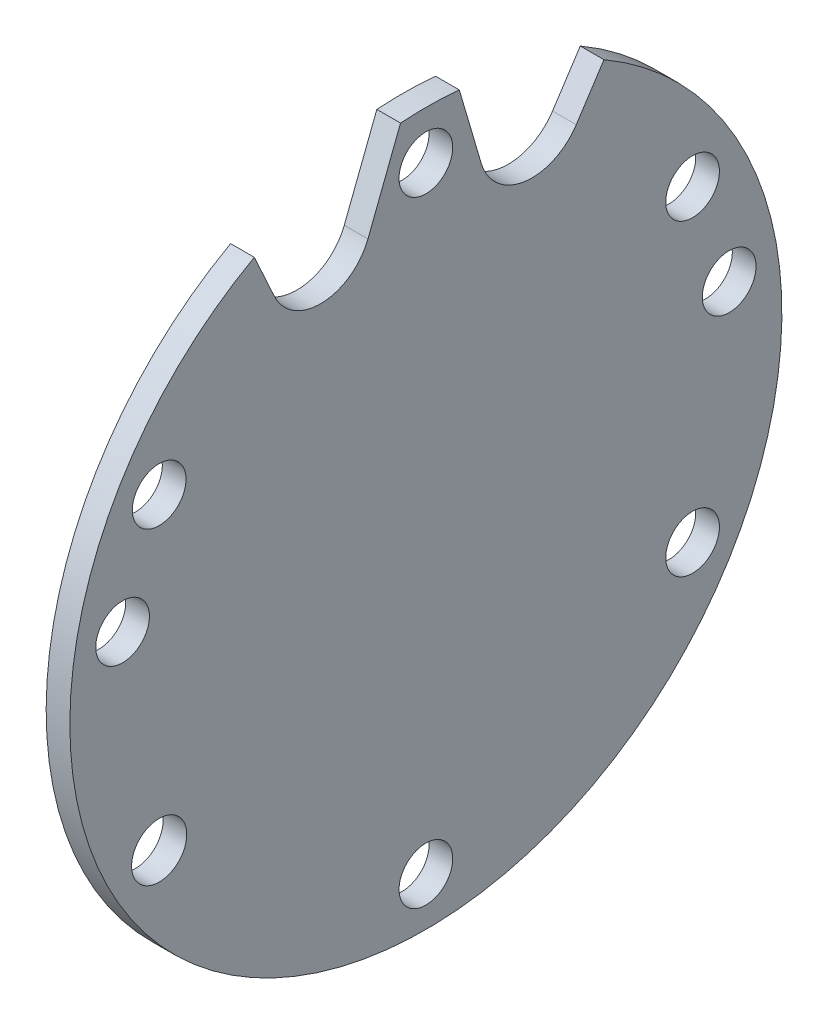
ISO-10303-21;
HEADER;
FILE_DESCRIPTION(('STEP AP214'),'2;1');
FILE_NAME('part.step','',(''),(''),'','','');
FILE_SCHEMA(('AUTOMOTIVE_DESIGN { 1 0 10303 214 1 1 1 1 }'));
ENDSEC;
DATA;
#1=APPLICATION_CONTEXT('core data for automotive mechanical design processes');
#2=APPLICATION_PROTOCOL_DEFINITION('international standard','automotive_design',2000,#1);
#3=PRODUCT_CONTEXT('',#1,'mechanical');
#4=PRODUCT('Part','Part','',(#3));
#5=PRODUCT_RELATED_PRODUCT_CATEGORY('part','',(#4));
#6=PRODUCT_DEFINITION_FORMATION('','',#4);
#7=PRODUCT_DEFINITION_CONTEXT('part definition',#1,'design');
#8=PRODUCT_DEFINITION('design','',#6,#7);
#9=PRODUCT_DEFINITION_SHAPE('','',#8);
#10=(LENGTH_UNIT() NAMED_UNIT(*) SI_UNIT(.MILLI.,.METRE.));
#11=(NAMED_UNIT(*) PLANE_ANGLE_UNIT() SI_UNIT($,.RADIAN.));
#12=(NAMED_UNIT(*) SI_UNIT($,.STERADIAN.) SOLID_ANGLE_UNIT());
#13=UNCERTAINTY_MEASURE_WITH_UNIT(LENGTH_MEASURE(1.E-05),#10,'distance_accuracy_value','');
#14=(GEOMETRIC_REPRESENTATION_CONTEXT(3) GLOBAL_UNCERTAINTY_ASSIGNED_CONTEXT((#13)) GLOBAL_UNIT_ASSIGNED_CONTEXT((#10,
#11,#12)) REPRESENTATION_CONTEXT('',''));
#15=CARTESIAN_POINT('',(0.,0.,0.));
#16=DIRECTION('',(0.,0.,1.));
#17=DIRECTION('',(1.,0.,0.));
#18=AXIS2_PLACEMENT_3D('',#15,#16,#17);
#19=CARTESIAN_POINT('',(3.,0.,0.));
#20=DIRECTION('',(1.,0.,0.));
#21=DIRECTION('',(0.,0.,-1.));
#22=AXIS2_PLACEMENT_3D('',#19,#20,#21);
#23=PLANE('',#22);
#24=CARTESIAN_POINT('',(3.,6.77227892894371,38.4075023674159));
#25=DIRECTION('',(1.,0.,0.));
#26=DIRECTION('',(0.,0.,-1.));
#27=AXIS2_PLACEMENT_3D('',#24,#25,#26);
#28=CIRCLE('',#27,3.4);
#29=CARTESIAN_POINT('',(3.,6.77227892894371,35.0075023674159));
#30=VERTEX_POINT('',#29);
#31=EDGE_CURVE('E212',#30,#30,#28,.T.);
#32=ORIENTED_EDGE('',*,*,#31,.F.);
#33=EDGE_LOOP('',(#32));
#34=FACE_BOUND('',#33,.T.);
#35=CARTESIAN_POINT('',(3.,-39.0000000000018,0.));
#36=DIRECTION('',(1.,0.,0.));
#37=DIRECTION('',(0.,0.,-1.));
#38=AXIS2_PLACEMENT_3D('',#35,#36,#37);
#39=CIRCLE('',#38,3.39999999982866);
#40=CARTESIAN_POINT('',(3.,-39.0000000000018,-3.39999999982866));
#41=VERTEX_POINT('',#40);
#42=EDGE_CURVE('E200',#41,#41,#39,.T.);
#43=ORIENTED_EDGE('',*,*,#42,.F.);
#44=EDGE_LOOP('',(#43));
#45=FACE_BOUND('',#44,.T.);
#46=CARTESIAN_POINT('',(3.,6.77227892894371,-38.4075023675377));
#47=DIRECTION('',(1.,0.,0.));
#48=DIRECTION('',(0.,0.,-1.));
#49=AXIS2_PLACEMENT_3D('',#46,#47,#48);
#50=CIRCLE('',#49,3.39999999994234);
#51=CARTESIAN_POINT('',(3.,6.77227892894371,-41.80750236748));
#52=VERTEX_POINT('',#51);
#53=EDGE_CURVE('E188',#52,#52,#50,.T.);
#54=ORIENTED_EDGE('',*,*,#53,.F.);
#55=EDGE_LOOP('',(#54));
#56=FACE_BOUND('',#55,.T.);
#57=CARTESIAN_POINT('',(3.,38.9999999999983,0.));
#58=DIRECTION('',(1.,0.,0.));
#59=DIRECTION('',(0.,0.,-1.));
#60=AXIS2_PLACEMENT_3D('',#57,#58,#59);
#61=CIRCLE('',#60,3.4);
#62=CARTESIAN_POINT('',(3.,38.9999999999983,-3.4));
#63=VERTEX_POINT('',#62);
#64=EDGE_CURVE('E134',#63,#63,#61,.T.);
#65=ORIENTED_EDGE('',*,*,#64,.F.);
#66=EDGE_LOOP('',(#65));
#67=FACE_BOUND('',#66,.T.);
#68=CARTESIAN_POINT('',(3.,0.,0.));
#69=DIRECTION('',(1.,0.,0.));
#70=DIRECTION('',(0.,0.,-1.));
#71=AXIS2_PLACEMENT_3D('',#68,#69,#70);
#72=CIRCLE('',#71,45.085);
#73=CARTESIAN_POINT('',(3.,39.5056464022037,21.7246663344698));
#74=VERTEX_POINT('',#73);
#75=CARTESIAN_POINT('',(3.,39.0393716674637,-22.5518222059689));
#76=VERTEX_POINT('',#75);
#77=EDGE_CURVE('E145',#74,#76,#72,.T.);
#78=ORIENTED_EDGE('',*,*,#77,.T.);
#79=DIRECTION('',(0.,-0.837514204424526,0.54641555375662));
#80=VECTOR('',#79,1.);
#81=CARTESIAN_POINT('',(3.,39.0393716674637,-22.5518222059689));
#82=LINE('',#81,#80);
#83=CARTESIAN_POINT('',(3.,33.6604309775915,-19.0424645853419));
#84=VERTEX_POINT('',#83);
#85=EDGE_CURVE('E93',#76,#84,#82,.T.);
#86=ORIENTED_EDGE('',*,*,#85,.T.);
#87=CARTESIAN_POINT('',(3.,37.3174378151793,-13.4372157026894));
#88=DIRECTION('',(-1.,0.,0.));
#89=DIRECTION('',(0.,0.,-1.));
#90=AXIS2_PLACEMENT_3D('',#87,#88,#89);
#91=CIRCLE('',#90,6.69272097480854);
#92=CARTESIAN_POINT('',(3.,35.4278375985655,-7.01678541586162));
#93=VERTEX_POINT('',#92);
#94=EDGE_CURVE('E160',#84,#93,#91,.T.);
#95=ORIENTED_EDGE('',*,*,#94,.T.);
#96=DIRECTION('',(0.,0.959315398175767,0.282336619698668));
#97=VECTOR('',#96,1.);
#98=CARTESIAN_POINT('',(3.,44.8858244892491,-4.23320031658371));
#99=LINE('',#98,#97);
#100=CARTESIAN_POINT('',(3.,44.8858244892491,-4.23320031658371));
#101=VERTEX_POINT('',#100);
#102=EDGE_CURVE('E173',#93,#101,#99,.T.);
#103=ORIENTED_EDGE('',*,*,#102,.T.);
#104=CARTESIAN_POINT('',(3.,0.,0.));
#105=DIRECTION('',(1.,0.,0.));
#106=DIRECTION('',(0.,0.,-1.));
#107=AXIS2_PLACEMENT_3D('',#104,#105,#106);
#108=CIRCLE('',#107,45.085);
#109=CARTESIAN_POINT('',(3.,44.970493516031,3.21122062845424));
#110=VERTEX_POINT('',#109);
#111=EDGE_CURVE('E112',#101,#110,#108,.T.);
#112=ORIENTED_EDGE('',*,*,#111,.T.);
#113=DIRECTION('',(0.,-0.932517432610584,0.361124961581673));
#114=VECTOR('',#113,1.);
#115=CARTESIAN_POINT('',(3.,34.3228741062931,7.33459786067762));
#116=LINE('',#115,#114);
#117=CARTESIAN_POINT('',(3.,34.3228741062931,7.33459786067762));
#118=VERTEX_POINT('',#117);
#119=EDGE_CURVE('E106',#110,#118,#116,.T.);
#120=ORIENTED_EDGE('',*,*,#119,.T.);
#121=CARTESIAN_POINT('',(3.,36.6480449071196,13.338786261477));
#122=DIRECTION('',(-1.,0.,0.));
#123=DIRECTION('',(0.,0.,-1.));
#124=AXIS2_PLACEMENT_3D('',#121,#122,#123);
#125=CIRCLE('',#124,6.438687568543);
#126=CARTESIAN_POINT('',(3.,33.9711163746531,19.1946167950032));
#127=VERTEX_POINT('',#126);
#128=EDGE_CURVE('E110',#118,#127,#125,.T.);
#129=ORIENTED_EDGE('',*,*,#128,.T.);
#130=DIRECTION('',(0.,0.909475800959117,0.415756861001442));
#131=VECTOR('',#130,1.);
#132=CARTESIAN_POINT('',(3.,39.5056464022037,21.7246663344698));
#133=LINE('',#132,#131);
#134=EDGE_CURVE('E50',#127,#74,#133,.T.);
#135=ORIENTED_EDGE('',*,*,#134,.T.);
#136=EDGE_LOOP('',(#78,#86,#95,#103,#112,#120,#129,#135));
#137=FACE_BOUND('',#136,.T.);
#138=CARTESIAN_POINT('',(3.,19.4999999999982,-33.7749907475954));
#139=DIRECTION('',(1.,0.,0.));
#140=DIRECTION('',(0.,0.,-1.));
#141=AXIS2_PLACEMENT_3D('',#138,#139,#140);
#142=CIRCLE('',#141,3.3999999998855);
#143=CARTESIAN_POINT('',(3.,19.4999999999982,-37.1749907474809));
#144=VERTEX_POINT('',#143);
#145=EDGE_CURVE('E182',#144,#144,#142,.T.);
#146=ORIENTED_EDGE('',*,*,#145,.F.);
#147=EDGE_LOOP('',(#146));
#148=FACE_BOUND('',#147,.T.);
#149=CARTESIAN_POINT('',(3.,-19.5000000000018,-33.7749907475936));
#150=DIRECTION('',(1.,0.,0.));
#151=DIRECTION('',(0.,0.,-1.));
#152=AXIS2_PLACEMENT_3D('',#149,#150,#151);
#153=CIRCLE('',#152,3.39999999988546);
#154=CARTESIAN_POINT('',(3.,-19.5000000000018,-37.1749907474791));
#155=VERTEX_POINT('',#154);
#156=EDGE_CURVE('E194',#155,#155,#153,.T.);
#157=ORIENTED_EDGE('',*,*,#156,.F.);
#158=EDGE_LOOP('',(#157));
#159=FACE_BOUND('',#158,.T.);
#160=CARTESIAN_POINT('',(3.,-19.5000000000017,33.7749907475918));
#161=DIRECTION('',(1.,0.,0.));
#162=DIRECTION('',(0.,0.,-1.));
#163=AXIS2_PLACEMENT_3D('',#160,#161,#162);
#164=CIRCLE('',#163,3.49288290040631);
#165=CARTESIAN_POINT('',(3.,-19.5000000000017,30.2821078471855));
#166=VERTEX_POINT('',#165);
#167=EDGE_CURVE('E206',#166,#166,#164,.T.);
#168=ORIENTED_EDGE('',*,*,#167,.F.);
#169=EDGE_LOOP('',(#168));
#170=FACE_BOUND('',#169,.T.);
#171=CARTESIAN_POINT('',(3.,19.4999999999982,33.7749907475918));
#172=DIRECTION('',(1.,0.,0.));
#173=DIRECTION('',(0.,0.,-1.));
#174=AXIS2_PLACEMENT_3D('',#171,#172,#173);
#175=CIRCLE('',#174,3.4);
#176=CARTESIAN_POINT('',(3.,19.4999999999982,30.3749907475918));
#177=VERTEX_POINT('',#176);
#178=EDGE_CURVE('E218',#177,#177,#175,.T.);
#179=ORIENTED_EDGE('',*,*,#178,.F.);
#180=EDGE_LOOP('',(#179));
#181=FACE_BOUND('',#180,.T.);
#182=ADVANCED_FACE('F33',(#34,#45,#56,#67,#137,#148,#159,#170,#181),#23,.T.);
#183=CARTESIAN_POINT('',(0.,0.,0.));
#184=DIRECTION('',(1.,0.,0.));
#185=DIRECTION('',(0.,0.,-1.));
#186=AXIS2_PLACEMENT_3D('',#183,#184,#185);
#187=PLANE('',#186);
#188=CARTESIAN_POINT('',(0.,6.77227892894371,38.4075023674159));
#189=DIRECTION('',(1.,0.,0.));
#190=DIRECTION('',(0.,0.,-1.));
#191=AXIS2_PLACEMENT_3D('',#188,#189,#190);
#192=CIRCLE('',#191,3.4);
#193=CARTESIAN_POINT('',(0.,6.77227892894371,35.0075023674159));
#194=VERTEX_POINT('',#193);
#195=EDGE_CURVE('E215',#194,#194,#192,.T.);
#196=ORIENTED_EDGE('',*,*,#195,.T.);
#197=EDGE_LOOP('',(#196));
#198=FACE_BOUND('',#197,.T.);
#199=CARTESIAN_POINT('',(0.,-39.0000000000018,0.));
#200=DIRECTION('',(1.,0.,0.));
#201=DIRECTION('',(0.,0.,-1.));
#202=AXIS2_PLACEMENT_3D('',#199,#200,#201);
#203=CIRCLE('',#202,3.39999999982866);
#204=CARTESIAN_POINT('',(0.,-39.0000000000018,-3.39999999982866));
#205=VERTEX_POINT('',#204);
#206=EDGE_CURVE('E203',#205,#205,#203,.T.);
#207=ORIENTED_EDGE('',*,*,#206,.T.);
#208=EDGE_LOOP('',(#207));
#209=FACE_BOUND('',#208,.T.);
#210=CARTESIAN_POINT('',(0.,6.77227892894371,-38.4075023675377));
#211=DIRECTION('',(1.,0.,0.));
#212=DIRECTION('',(0.,0.,-1.));
#213=AXIS2_PLACEMENT_3D('',#210,#211,#212);
#214=CIRCLE('',#213,3.39999999994234);
#215=CARTESIAN_POINT('',(0.,6.77227892894371,-41.80750236748));
#216=VERTEX_POINT('',#215);
#217=EDGE_CURVE('E191',#216,#216,#214,.T.);
#218=ORIENTED_EDGE('',*,*,#217,.T.);
#219=EDGE_LOOP('',(#218));
#220=FACE_BOUND('',#219,.T.);
#221=CARTESIAN_POINT('',(0.,38.9999999999983,0.));
#222=DIRECTION('',(1.,0.,0.));
#223=DIRECTION('',(0.,0.,-1.));
#224=AXIS2_PLACEMENT_3D('',#221,#222,#223);
#225=CIRCLE('',#224,3.4);
#226=CARTESIAN_POINT('',(0.,38.9999999999983,-3.4));
#227=VERTEX_POINT('',#226);
#228=EDGE_CURVE('E179',#227,#227,#225,.T.);
#229=ORIENTED_EDGE('',*,*,#228,.T.);
#230=EDGE_LOOP('',(#229));
#231=FACE_BOUND('',#230,.T.);
#232=CARTESIAN_POINT('',(0.,0.,0.));
#233=DIRECTION('',(1.,0.,0.));
#234=DIRECTION('',(0.,0.,-1.));
#235=AXIS2_PLACEMENT_3D('',#232,#233,#234);
#236=CIRCLE('',#235,45.085);
#237=CARTESIAN_POINT('',(0.,39.5056464022037,21.7246663344698));
#238=VERTEX_POINT('',#237);
#239=CARTESIAN_POINT('',(0.,39.0393716674637,-22.5518222059689));
#240=VERTEX_POINT('',#239);
#241=EDGE_CURVE('E130',#238,#240,#236,.T.);
#242=ORIENTED_EDGE('',*,*,#241,.F.);
#243=DIRECTION('',(0.,0.909475800959117,0.415756861001442));
#244=VECTOR('',#243,1.);
#245=CARTESIAN_POINT('',(0.,39.5056464022037,21.7246663344698));
#246=LINE('',#245,#244);
#247=CARTESIAN_POINT('',(0.,33.9711163746531,19.1946167950032));
#248=VERTEX_POINT('',#247);
#249=EDGE_CURVE('E85',#248,#238,#246,.T.);
#250=ORIENTED_EDGE('',*,*,#249,.F.);
#251=CARTESIAN_POINT('',(0.,36.6480449071196,13.338786261477));
#252=DIRECTION('',(-1.,0.,0.));
#253=DIRECTION('',(0.,0.,-1.));
#254=AXIS2_PLACEMENT_3D('',#251,#252,#253);
#255=CIRCLE('',#254,6.438687568543);
#256=CARTESIAN_POINT('',(0.,34.3228741062931,7.33459786067762));
#257=VERTEX_POINT('',#256);
#258=EDGE_CURVE('E79',#257,#248,#255,.T.);
#259=ORIENTED_EDGE('',*,*,#258,.F.);
#260=DIRECTION('',(0.,-0.932517432610584,0.361124961581673));
#261=VECTOR('',#260,1.);
#262=CARTESIAN_POINT('',(0.,34.3228741062931,7.33459786067762));
#263=LINE('',#262,#261);
#264=CARTESIAN_POINT('',(0.,44.970493516031,3.21122062845424));
#265=VERTEX_POINT('',#264);
#266=EDGE_CURVE('E120',#265,#257,#263,.T.);
#267=ORIENTED_EDGE('',*,*,#266,.F.);
#268=CARTESIAN_POINT('',(0.,0.,0.));
#269=DIRECTION('',(1.,0.,0.));
#270=DIRECTION('',(0.,0.,-1.));
#271=AXIS2_PLACEMENT_3D('',#268,#269,#270);
#272=CIRCLE('',#271,45.085);
#273=CARTESIAN_POINT('',(0.,44.8858244892491,-4.23320031658371));
#274=VERTEX_POINT('',#273);
#275=EDGE_CURVE('E140',#274,#265,#272,.T.);
#276=ORIENTED_EDGE('',*,*,#275,.F.);
#277=DIRECTION('',(0.,0.959315398175767,0.282336619698668));
#278=VECTOR('',#277,1.);
#279=CARTESIAN_POINT('',(0.,44.8858244892491,-4.23320031658371));
#280=LINE('',#279,#278);
#281=CARTESIAN_POINT('',(0.,35.4278375985655,-7.01678541586162));
#282=VERTEX_POINT('',#281);
#283=EDGE_CURVE('E138',#282,#274,#280,.T.);
#284=ORIENTED_EDGE('',*,*,#283,.F.);
#285=CARTESIAN_POINT('',(0.,37.3174378151793,-13.4372157026894));
#286=DIRECTION('',(-1.,0.,0.));
#287=DIRECTION('',(0.,0.,-1.));
#288=AXIS2_PLACEMENT_3D('',#285,#286,#287);
#289=CIRCLE('',#288,6.69272097480854);
#290=CARTESIAN_POINT('',(0.,33.6604309775915,-19.0424645853419));
#291=VERTEX_POINT('',#290);
#292=EDGE_CURVE('E136',#291,#282,#289,.T.);
#293=ORIENTED_EDGE('',*,*,#292,.F.);
#294=DIRECTION('',(0.,-0.837514204424526,0.54641555375662));
#295=VECTOR('',#294,1.);
#296=CARTESIAN_POINT('',(0.,39.0393716674637,-22.5518222059689));
#297=LINE('',#296,#295);
#298=EDGE_CURVE('E133',#240,#291,#297,.T.);
#299=ORIENTED_EDGE('',*,*,#298,.F.);
#300=EDGE_LOOP('',(#242,#250,#259,#267,#276,#284,#293,#299));
#301=FACE_BOUND('',#300,.T.);
#302=CARTESIAN_POINT('',(0.,19.4999999999982,-33.7749907475954));
#303=DIRECTION('',(1.,0.,0.));
#304=DIRECTION('',(0.,0.,-1.));
#305=AXIS2_PLACEMENT_3D('',#302,#303,#304);
#306=CIRCLE('',#305,3.3999999998855);
#307=CARTESIAN_POINT('',(0.,19.4999999999982,-37.1749907474809));
#308=VERTEX_POINT('',#307);
#309=EDGE_CURVE('E185',#308,#308,#306,.T.);
#310=ORIENTED_EDGE('',*,*,#309,.T.);
#311=EDGE_LOOP('',(#310));
#312=FACE_BOUND('',#311,.T.);
#313=CARTESIAN_POINT('',(0.,-19.5000000000018,-33.7749907475936));
#314=DIRECTION('',(1.,0.,0.));
#315=DIRECTION('',(0.,0.,-1.));
#316=AXIS2_PLACEMENT_3D('',#313,#314,#315);
#317=CIRCLE('',#316,3.39999999988546);
#318=CARTESIAN_POINT('',(0.,-19.5000000000018,-37.1749907474791));
#319=VERTEX_POINT('',#318);
#320=EDGE_CURVE('E197',#319,#319,#317,.T.);
#321=ORIENTED_EDGE('',*,*,#320,.T.);
#322=EDGE_LOOP('',(#321));
#323=FACE_BOUND('',#322,.T.);
#324=CARTESIAN_POINT('',(0.,-19.5000000000017,33.7749907475918));
#325=DIRECTION('',(1.,0.,0.));
#326=DIRECTION('',(0.,0.,-1.));
#327=AXIS2_PLACEMENT_3D('',#324,#325,#326);
#328=CIRCLE('',#327,3.49288290040631);
#329=CARTESIAN_POINT('',(0.,-19.5000000000017,30.2821078471855));
#330=VERTEX_POINT('',#329);
#331=EDGE_CURVE('E209',#330,#330,#328,.T.);
#332=ORIENTED_EDGE('',*,*,#331,.T.);
#333=EDGE_LOOP('',(#332));
#334=FACE_BOUND('',#333,.T.);
#335=CARTESIAN_POINT('',(0.,19.4999999999982,33.7749907475918));
#336=DIRECTION('',(1.,0.,0.));
#337=DIRECTION('',(0.,0.,-1.));
#338=AXIS2_PLACEMENT_3D('',#335,#336,#337);
#339=CIRCLE('',#338,3.4);
#340=CARTESIAN_POINT('',(0.,19.4999999999982,30.3749907475918));
#341=VERTEX_POINT('',#340);
#342=EDGE_CURVE('E221',#341,#341,#339,.T.);
#343=ORIENTED_EDGE('',*,*,#342,.T.);
#344=EDGE_LOOP('',(#343));
#345=FACE_BOUND('',#344,.T.);
#346=ADVANCED_FACE('F164',(#198,#209,#220,#231,#301,#312,#323,#334,#345),#187,.F.);
#347=CARTESIAN_POINT('',(3.,0.,0.));
#348=DIRECTION('',(-1.,0.,0.));
#349=DIRECTION('',(0.,0.,1.));
#350=AXIS2_PLACEMENT_3D('',#347,#348,#349);
#351=CYLINDRICAL_SURFACE('',#350,45.085);
#352=ORIENTED_EDGE('',*,*,#241,.T.);
#353=DIRECTION('',(-1.,0.,0.));
#354=VECTOR('',#353,1.);
#355=CARTESIAN_POINT('',(3.,39.0393716674637,-22.5518222059689));
#356=LINE('',#355,#354);
#357=EDGE_CURVE('E11',#76,#240,#356,.T.);
#358=ORIENTED_EDGE('',*,*,#357,.F.);
#359=ORIENTED_EDGE('',*,*,#77,.F.);
#360=DIRECTION('',(-1.,0.,0.));
#361=VECTOR('',#360,1.);
#362=CARTESIAN_POINT('',(3.,39.5056464022037,21.7246663344698));
#363=LINE('',#362,#361);
#364=EDGE_CURVE('E126',#74,#238,#363,.T.);
#365=ORIENTED_EDGE('',*,*,#364,.T.);
#366=EDGE_LOOP('',(#352,#358,#359,#365));
#367=FACE_BOUND('',#366,.T.);
#368=ADVANCED_FACE('F35',(#367),#351,.T.);
#369=CARTESIAN_POINT('',(3.,39.0393716674637,-22.5518222059689));
#370=DIRECTION('',(0.,-0.54641555375662,-0.837514204424526));
#371=DIRECTION('',(0.,0.837514204424526,-0.54641555375662));
#372=AXIS2_PLACEMENT_3D('',#369,#370,#371);
#373=PLANE('',#372);
#374=ORIENTED_EDGE('',*,*,#298,.T.);
#375=DIRECTION('',(-1.,0.,0.));
#376=VECTOR('',#375,1.);
#377=CARTESIAN_POINT('',(3.,33.6604309775915,-19.0424645853419));
#378=LINE('',#377,#376);
#379=EDGE_CURVE('E42',#84,#291,#378,.T.);
#380=ORIENTED_EDGE('',*,*,#379,.F.);
#381=ORIENTED_EDGE('',*,*,#85,.F.);
#382=ORIENTED_EDGE('',*,*,#357,.T.);
#383=EDGE_LOOP('',(#374,#380,#381,#382));
#384=FACE_BOUND('',#383,.T.);
#385=ADVANCED_FACE('F256',(#384),#373,.F.);
#386=CARTESIAN_POINT('',(3.,37.3174378151793,-13.4372157026894));
#387=DIRECTION('',(-1.,0.,0.));
#388=DIRECTION('',(0.,0.,1.));
#389=AXIS2_PLACEMENT_3D('',#386,#387,#388);
#390=CYLINDRICAL_SURFACE('',#389,6.69272097480854);
#391=ORIENTED_EDGE('',*,*,#292,.T.);
#392=DIRECTION('',(-1.,0.,0.));
#393=VECTOR('',#392,1.);
#394=CARTESIAN_POINT('',(3.,35.4278375985655,-7.01678541586162));
#395=LINE('',#394,#393);
#396=EDGE_CURVE('E152',#93,#282,#395,.T.);
#397=ORIENTED_EDGE('',*,*,#396,.F.);
#398=ORIENTED_EDGE('',*,*,#94,.F.);
#399=ORIENTED_EDGE('',*,*,#379,.T.);
#400=EDGE_LOOP('',(#391,#397,#398,#399));
#401=FACE_BOUND('',#400,.T.);
#402=ADVANCED_FACE('F158',(#401),#390,.F.);
#403=CARTESIAN_POINT('',(3.,44.8858244892491,-4.23320031658371));
#404=DIRECTION('',(0.,-0.282336619698668,0.959315398175767));
#405=DIRECTION('',(0.,-0.959315398175767,-0.282336619698668));
#406=AXIS2_PLACEMENT_3D('',#403,#404,#405);
#407=PLANE('',#406);
#408=ORIENTED_EDGE('',*,*,#283,.T.);
#409=DIRECTION('',(-1.,0.,0.));
#410=VECTOR('',#409,1.);
#411=CARTESIAN_POINT('',(3.,44.8858244892491,-4.23320031658371));
#412=LINE('',#411,#410);
#413=EDGE_CURVE('E149',#101,#274,#412,.T.);
#414=ORIENTED_EDGE('',*,*,#413,.F.);
#415=ORIENTED_EDGE('',*,*,#102,.F.);
#416=ORIENTED_EDGE('',*,*,#396,.T.);
#417=EDGE_LOOP('',(#408,#414,#415,#416));
#418=FACE_BOUND('',#417,.T.);
#419=ADVANCED_FACE('F169',(#418),#407,.F.);
#420=CARTESIAN_POINT('',(3.,0.,0.));
#421=DIRECTION('',(-1.,0.,0.));
#422=DIRECTION('',(0.,0.,1.));
#423=AXIS2_PLACEMENT_3D('',#420,#421,#422);
#424=CYLINDRICAL_SURFACE('',#423,45.085);
#425=ORIENTED_EDGE('',*,*,#275,.T.);
#426=DIRECTION('',(-1.,0.,0.));
#427=VECTOR('',#426,1.);
#428=CARTESIAN_POINT('',(3.,44.970493516031,3.21122062845424));
#429=LINE('',#428,#427);
#430=EDGE_CURVE('E121',#110,#265,#429,.T.);
#431=ORIENTED_EDGE('',*,*,#430,.F.);
#432=ORIENTED_EDGE('',*,*,#111,.F.);
#433=ORIENTED_EDGE('',*,*,#413,.T.);
#434=EDGE_LOOP('',(#425,#431,#432,#433));
#435=FACE_BOUND('',#434,.T.);
#436=ADVANCED_FACE('F172',(#435),#424,.T.);
#437=CARTESIAN_POINT('',(3.,34.3228741062931,7.33459786067762));
#438=DIRECTION('',(0.,-0.361124961581673,-0.932517432610584));
#439=DIRECTION('',(0.,0.932517432610584,-0.361124961581673));
#440=AXIS2_PLACEMENT_3D('',#437,#438,#439);
#441=PLANE('',#440);
#442=ORIENTED_EDGE('',*,*,#266,.T.);
#443=DIRECTION('',(-1.,0.,0.));
#444=VECTOR('',#443,1.);
#445=CARTESIAN_POINT('',(3.,34.3228741062931,7.33459786067762));
#446=LINE('',#445,#444);
#447=EDGE_CURVE('E117',#118,#257,#446,.T.);
#448=ORIENTED_EDGE('',*,*,#447,.F.);
#449=ORIENTED_EDGE('',*,*,#119,.F.);
#450=ORIENTED_EDGE('',*,*,#430,.T.);
#451=EDGE_LOOP('',(#442,#448,#449,#450));
#452=FACE_BOUND('',#451,.T.);
#453=ADVANCED_FACE('F118',(#452),#441,.F.);
#454=CARTESIAN_POINT('',(3.,36.6480449071196,13.338786261477));
#455=DIRECTION('',(-1.,0.,0.));
#456=DIRECTION('',(0.,0.,1.));
#457=AXIS2_PLACEMENT_3D('',#454,#455,#456);
#458=CYLINDRICAL_SURFACE('',#457,6.438687568543);
#459=ORIENTED_EDGE('',*,*,#258,.T.);
#460=DIRECTION('',(-1.,0.,0.));
#461=VECTOR('',#460,1.);
#462=CARTESIAN_POINT('',(3.,33.9711163746531,19.1946167950032));
#463=LINE('',#462,#461);
#464=EDGE_CURVE('E122',#127,#248,#463,.T.);
#465=ORIENTED_EDGE('',*,*,#464,.F.);
#466=ORIENTED_EDGE('',*,*,#128,.F.);
#467=ORIENTED_EDGE('',*,*,#447,.T.);
#468=EDGE_LOOP('',(#459,#465,#466,#467));
#469=FACE_BOUND('',#468,.T.);
#470=ADVANCED_FACE('F124',(#469),#458,.F.);
#471=CARTESIAN_POINT('',(3.,39.5056464022037,21.7246663344698));
#472=DIRECTION('',(0.,-0.415756861001442,0.909475800959117));
#473=DIRECTION('',(0.,-0.909475800959117,-0.415756861001442));
#474=AXIS2_PLACEMENT_3D('',#471,#472,#473);
#475=PLANE('',#474);
#476=ORIENTED_EDGE('',*,*,#249,.T.);
#477=ORIENTED_EDGE('',*,*,#364,.F.);
#478=ORIENTED_EDGE('',*,*,#134,.F.);
#479=ORIENTED_EDGE('',*,*,#464,.T.);
#480=EDGE_LOOP('',(#476,#477,#478,#479));
#481=FACE_BOUND('',#480,.T.);
#482=ADVANCED_FACE('F244',(#481),#475,.F.);
#483=CARTESIAN_POINT('',(3.,38.9999999999983,0.));
#484=DIRECTION('',(-1.,0.,0.));
#485=DIRECTION('',(0.,0.,1.));
#486=AXIS2_PLACEMENT_3D('',#483,#484,#485);
#487=CYLINDRICAL_SURFACE('',#486,3.4);
#488=ORIENTED_EDGE('',*,*,#64,.T.);
#489=EDGE_LOOP('',(#488));
#490=FACE_BOUND('',#489,.T.);
#491=ORIENTED_EDGE('',*,*,#228,.F.);
#492=EDGE_LOOP('',(#491));
#493=FACE_BOUND('',#492,.T.);
#494=ADVANCED_FACE('F241',(#490,#493),#487,.F.);
#495=CARTESIAN_POINT('',(3.,19.4999999999982,-33.7749907475954));
#496=DIRECTION('',(-1.,0.,0.));
#497=DIRECTION('',(0.,0.,1.));
#498=AXIS2_PLACEMENT_3D('',#495,#496,#497);
#499=CYLINDRICAL_SURFACE('',#498,3.3999999998855);
#500=ORIENTED_EDGE('',*,*,#145,.T.);
#501=EDGE_LOOP('',(#500));
#502=FACE_BOUND('',#501,.T.);
#503=ORIENTED_EDGE('',*,*,#309,.F.);
#504=EDGE_LOOP('',(#503));
#505=FACE_BOUND('',#504,.T.);
#506=ADVANCED_FACE('F320',(#502,#505),#499,.F.);
#507=CARTESIAN_POINT('',(3.,6.77227892894371,-38.4075023675377));
#508=DIRECTION('',(-1.,0.,0.));
#509=DIRECTION('',(0.,0.,1.));
#510=AXIS2_PLACEMENT_3D('',#507,#508,#509);
#511=CYLINDRICAL_SURFACE('',#510,3.39999999994234);
#512=ORIENTED_EDGE('',*,*,#53,.T.);
#513=EDGE_LOOP('',(#512));
#514=FACE_BOUND('',#513,.T.);
#515=ORIENTED_EDGE('',*,*,#217,.F.);
#516=EDGE_LOOP('',(#515));
#517=FACE_BOUND('',#516,.T.);
#518=ADVANCED_FACE('F328',(#514,#517),#511,.F.);
#519=CARTESIAN_POINT('',(3.,-19.5000000000018,-33.7749907475936));
#520=DIRECTION('',(-1.,0.,0.));
#521=DIRECTION('',(0.,0.,1.));
#522=AXIS2_PLACEMENT_3D('',#519,#520,#521);
#523=CYLINDRICAL_SURFACE('',#522,3.39999999988546);
#524=ORIENTED_EDGE('',*,*,#156,.T.);
#525=EDGE_LOOP('',(#524));
#526=FACE_BOUND('',#525,.T.);
#527=ORIENTED_EDGE('',*,*,#320,.F.);
#528=EDGE_LOOP('',(#527));
#529=FACE_BOUND('',#528,.T.);
#530=ADVANCED_FACE('F336',(#526,#529),#523,.F.);
#531=CARTESIAN_POINT('',(3.,-39.0000000000018,0.));
#532=DIRECTION('',(-1.,0.,0.));
#533=DIRECTION('',(0.,0.,1.));
#534=AXIS2_PLACEMENT_3D('',#531,#532,#533);
#535=CYLINDRICAL_SURFACE('',#534,3.39999999982866);
#536=ORIENTED_EDGE('',*,*,#42,.T.);
#537=EDGE_LOOP('',(#536));
#538=FACE_BOUND('',#537,.T.);
#539=ORIENTED_EDGE('',*,*,#206,.F.);
#540=EDGE_LOOP('',(#539));
#541=FACE_BOUND('',#540,.T.);
#542=ADVANCED_FACE('F345',(#538,#541),#535,.F.);
#543=CARTESIAN_POINT('',(3.,-19.5000000000017,33.7749907475918));
#544=DIRECTION('',(-1.,0.,0.));
#545=DIRECTION('',(0.,0.,1.));
#546=AXIS2_PLACEMENT_3D('',#543,#544,#545);
#547=CYLINDRICAL_SURFACE('',#546,3.49288290040631);
#548=ORIENTED_EDGE('',*,*,#167,.T.);
#549=EDGE_LOOP('',(#548));
#550=FACE_BOUND('',#549,.T.);
#551=ORIENTED_EDGE('',*,*,#331,.F.);
#552=EDGE_LOOP('',(#551));
#553=FACE_BOUND('',#552,.T.);
#554=ADVANCED_FACE('F354',(#550,#553),#547,.F.);
#555=CARTESIAN_POINT('',(3.,6.77227892894371,38.4075023674159));
#556=DIRECTION('',(-1.,0.,0.));
#557=DIRECTION('',(0.,0.,1.));
#558=AXIS2_PLACEMENT_3D('',#555,#556,#557);
#559=CYLINDRICAL_SURFACE('',#558,3.4);
#560=ORIENTED_EDGE('',*,*,#31,.T.);
#561=EDGE_LOOP('',(#560));
#562=FACE_BOUND('',#561,.T.);
#563=ORIENTED_EDGE('',*,*,#195,.F.);
#564=EDGE_LOOP('',(#563));
#565=FACE_BOUND('',#564,.T.);
#566=ADVANCED_FACE('F363',(#562,#565),#559,.F.);
#567=CARTESIAN_POINT('',(3.,19.4999999999982,33.7749907475918));
#568=DIRECTION('',(-1.,0.,0.));
#569=DIRECTION('',(0.,0.,1.));
#570=AXIS2_PLACEMENT_3D('',#567,#568,#569);
#571=CYLINDRICAL_SURFACE('',#570,3.4);
#572=ORIENTED_EDGE('',*,*,#178,.T.);
#573=EDGE_LOOP('',(#572));
#574=FACE_BOUND('',#573,.T.);
#575=ORIENTED_EDGE('',*,*,#342,.F.);
#576=EDGE_LOOP('',(#575));
#577=FACE_BOUND('',#576,.T.);
#578=ADVANCED_FACE('F227',(#574,#577),#571,.F.);
#579=CLOSED_SHELL('',(#182,#346,#368,#385,#402,#419,#436,#453,#470,#482,#494,#506,#518,#530,
#542,#554,#566,#578));
#580=MANIFOLD_SOLID_BREP('B2',#579);
#581=ADVANCED_BREP_SHAPE_REPRESENTATION('',(#18,#580),#14);
#582=SHAPE_DEFINITION_REPRESENTATION(#9,#581);
ENDSEC;
END-ISO-10303-21;
